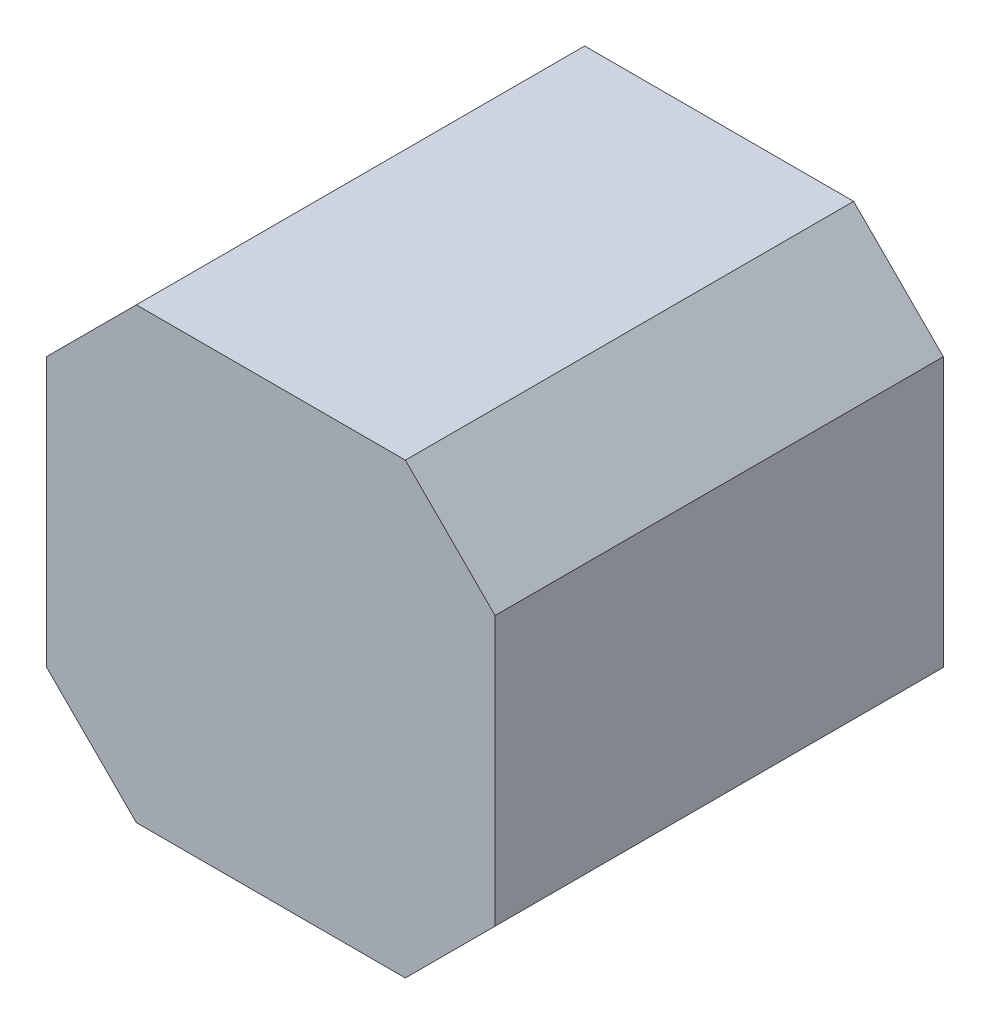
ISO-10303-21;
HEADER;
FILE_DESCRIPTION(('STEP AP214'),'2;1');
FILE_NAME('part.step','',(''),(''),'','','');
FILE_SCHEMA(('AUTOMOTIVE_DESIGN { 1 0 10303 214 1 1 1 1 }'));
ENDSEC;
DATA;
#1=APPLICATION_CONTEXT('core data for automotive mechanical design processes');
#2=APPLICATION_PROTOCOL_DEFINITION('international standard','automotive_design',2000,#1);
#3=PRODUCT_CONTEXT('',#1,'mechanical');
#4=PRODUCT('Part','Part','',(#3));
#5=PRODUCT_RELATED_PRODUCT_CATEGORY('part','',(#4));
#6=PRODUCT_DEFINITION_FORMATION('','',#4);
#7=PRODUCT_DEFINITION_CONTEXT('part definition',#1,'design');
#8=PRODUCT_DEFINITION('design','',#6,#7);
#9=PRODUCT_DEFINITION_SHAPE('','',#8);
#10=(LENGTH_UNIT() NAMED_UNIT(*) SI_UNIT(.MILLI.,.METRE.));
#11=(NAMED_UNIT(*) PLANE_ANGLE_UNIT() SI_UNIT($,.RADIAN.));
#12=(NAMED_UNIT(*) SI_UNIT($,.STERADIAN.) SOLID_ANGLE_UNIT());
#13=UNCERTAINTY_MEASURE_WITH_UNIT(LENGTH_MEASURE(1.E-05),#10,'distance_accuracy_value','');
#14=(GEOMETRIC_REPRESENTATION_CONTEXT(3) GLOBAL_UNCERTAINTY_ASSIGNED_CONTEXT((#13)) GLOBAL_UNIT_ASSIGNED_CONTEXT((#10,
#11,#12)) REPRESENTATION_CONTEXT('',''));
#15=CARTESIAN_POINT('',(0.,0.,0.));
#16=DIRECTION('',(0.,0.,1.));
#17=DIRECTION('',(1.,0.,0.));
#18=AXIS2_PLACEMENT_3D('',#15,#16,#17);
#19=CARTESIAN_POINT('',(1.270508,0.7622286,0.));
#20=DIRECTION('',(1.,0.,0.));
#21=DIRECTION('',(0.,0.,-1.));
#22=AXIS2_PLACEMENT_3D('',#19,#20,#21);
#23=PLANE('',#22);
#24=DIRECTION('',(0.,0.,1.));
#25=VECTOR('',#24,1.);
#26=CARTESIAN_POINT('',(1.270508,-0.76218796,0.));
#27=LINE('',#26,#25);
#28=CARTESIAN_POINT('',(1.270508,-0.76218796,0.));
#29=VERTEX_POINT('',#28);
#30=CARTESIAN_POINT('',(1.270508,-0.76218796,2.54));
#31=VERTEX_POINT('',#30);
#32=EDGE_CURVE('E159',#29,#31,#27,.T.);
#33=ORIENTED_EDGE('',*,*,#32,.F.);
#34=DIRECTION('',(0.,1.,0.));
#35=VECTOR('',#34,1.);
#36=CARTESIAN_POINT('',(1.270508,0.7622286,0.));
#37=LINE('',#36,#35);
#38=CARTESIAN_POINT('',(1.270508,0.7622286,0.));
#39=VERTEX_POINT('',#38);
#40=EDGE_CURVE('E92',#29,#39,#37,.T.);
#41=ORIENTED_EDGE('',*,*,#40,.T.);
#42=DIRECTION('',(0.,0.,1.));
#43=VECTOR('',#42,1.);
#44=CARTESIAN_POINT('',(1.270508,0.7622286,0.));
#45=LINE('',#44,#43);
#46=CARTESIAN_POINT('',(1.270508,0.7622286,2.54));
#47=VERTEX_POINT('',#46);
#48=EDGE_CURVE('E78',#47,#39,#45,.F.);
#49=ORIENTED_EDGE('',*,*,#48,.F.);
#50=DIRECTION('',(0.,1.,0.));
#51=VECTOR('',#50,1.);
#52=CARTESIAN_POINT('',(1.270508,0.7622286,2.54));
#53=LINE('',#52,#51);
#54=EDGE_CURVE('E68',#47,#31,#53,.F.);
#55=ORIENTED_EDGE('',*,*,#54,.T.);
#56=EDGE_LOOP('',(#33,#41,#49,#55));
#57=FACE_BOUND('',#56,.T.);
#58=ADVANCED_FACE('F17',(#57),#23,.T.);
#59=CARTESIAN_POINT('',(1.270508,-0.76218796,0.));
#60=DIRECTION('',(0.707106781186548,-0.707106781186548,0.));
#61=DIRECTION('',(0.707106781186548,0.707106781186548,0.));
#62=AXIS2_PLACEMENT_3D('',#59,#60,#61);
#63=PLANE('',#62);
#64=DIRECTION('',(0.,0.,1.));
#65=VECTOR('',#64,1.);
#66=CARTESIAN_POINT('',(0.76220828,-1.27048768,0.));
#67=LINE('',#66,#65);
#68=CARTESIAN_POINT('',(0.76220828,-1.27048768,0.));
#69=VERTEX_POINT('',#68);
#70=CARTESIAN_POINT('',(0.76220828,-1.27048768,2.54));
#71=VERTEX_POINT('',#70);
#72=EDGE_CURVE('E96',#69,#71,#67,.T.);
#73=ORIENTED_EDGE('',*,*,#72,.F.);
#74=DIRECTION('',(0.707106781186548,0.707106781186548,0.));
#75=VECTOR('',#74,1.);
#76=CARTESIAN_POINT('',(1.270508,-0.76218796,0.));
#77=LINE('',#76,#75);
#78=EDGE_CURVE('E85',#69,#29,#77,.T.);
#79=ORIENTED_EDGE('',*,*,#78,.T.);
#80=ORIENTED_EDGE('',*,*,#32,.T.);
#81=DIRECTION('',(0.707106781186548,0.707106781186548,0.));
#82=VECTOR('',#81,1.);
#83=CARTESIAN_POINT('',(1.270508,-0.76218796,2.54));
#84=LINE('',#83,#82);
#85=EDGE_CURVE('E91',#31,#71,#84,.F.);
#86=ORIENTED_EDGE('',*,*,#85,.T.);
#87=EDGE_LOOP('',(#73,#79,#80,#86));
#88=FACE_BOUND('',#87,.T.);
#89=ADVANCED_FACE('F169',(#88),#63,.T.);
#90=CARTESIAN_POINT('',(0.76220828,1.27052832,0.));
#91=DIRECTION('',(0.707106781186548,0.707106781186548,0.));
#92=DIRECTION('',(-0.707106781186548,0.707106781186548,0.));
#93=AXIS2_PLACEMENT_3D('',#90,#91,#92);
#94=PLANE('',#93);
#95=ORIENTED_EDGE('',*,*,#48,.T.);
#96=DIRECTION('',(-0.707106781186548,0.707106781186548,0.));
#97=VECTOR('',#96,1.);
#98=CARTESIAN_POINT('',(0.76220828,1.27052832,0.));
#99=LINE('',#98,#97);
#100=CARTESIAN_POINT('',(0.76220828,1.27052832,0.));
#101=VERTEX_POINT('',#100);
#102=EDGE_CURVE('E94',#39,#101,#99,.T.);
#103=ORIENTED_EDGE('',*,*,#102,.T.);
#104=DIRECTION('',(0.,0.,1.));
#105=VECTOR('',#104,1.);
#106=CARTESIAN_POINT('',(0.76220828,1.27052832,0.));
#107=LINE('',#106,#105);
#108=CARTESIAN_POINT('',(0.76220828,1.27052832,2.54));
#109=VERTEX_POINT('',#108);
#110=EDGE_CURVE('E81',#109,#101,#107,.F.);
#111=ORIENTED_EDGE('',*,*,#110,.F.);
#112=DIRECTION('',(-0.707106781186548,0.707106781186548,0.));
#113=VECTOR('',#112,1.);
#114=CARTESIAN_POINT('',(0.76220828,1.27052832,2.54));
#115=LINE('',#114,#113);
#116=EDGE_CURVE('E75',#109,#47,#115,.F.);
#117=ORIENTED_EDGE('',*,*,#116,.T.);
#118=EDGE_LOOP('',(#95,#103,#111,#117));
#119=FACE_BOUND('',#118,.T.);
#120=ADVANCED_FACE('F76',(#119),#94,.T.);
#121=CARTESIAN_POINT('',(0.76220828,-1.27048768,0.));
#122=DIRECTION('',(-7.83026645502871E-05,-0.999999996934346,0.));
#123=DIRECTION('',(0.999999996934346,-7.83026645502871E-05,0.));
#124=AXIS2_PLACEMENT_3D('',#121,#122,#123);
#125=PLANE('',#124);
#126=DIRECTION('',(0.,0.,1.));
#127=VECTOR('',#126,1.);
#128=CARTESIAN_POINT('',(-0.762327655226297,-1.2703683047737,0.));
#129=LINE('',#128,#127);
#130=CARTESIAN_POINT('',(-0.762343707192333,-1.27034585939998,0.));
#131=VERTEX_POINT('',#130);
#132=CARTESIAN_POINT('',(-0.762343707192333,-1.27034585939998,2.54));
#133=VERTEX_POINT('',#132);
#134=EDGE_CURVE('E106',#131,#133,#129,.T.);
#135=ORIENTED_EDGE('',*,*,#134,.F.);
#136=DIRECTION('',(0.999999996934346,-7.83026645502871E-05,0.));
#137=VECTOR('',#136,1.);
#138=CARTESIAN_POINT('',(0.76220828,-1.27048768,0.));
#139=LINE('',#138,#137);
#140=EDGE_CURVE('E122',#131,#69,#139,.T.);
#141=ORIENTED_EDGE('',*,*,#140,.T.);
#142=ORIENTED_EDGE('',*,*,#72,.T.);
#143=DIRECTION('',(0.999999996934346,-7.83026645502871E-05,0.));
#144=VECTOR('',#143,1.);
#145=CARTESIAN_POINT('',(0.76220828,-1.27048768,2.54));
#146=LINE('',#145,#144);
#147=EDGE_CURVE('E144',#71,#133,#146,.F.);
#148=ORIENTED_EDGE('',*,*,#147,.T.);
#149=EDGE_LOOP('',(#135,#141,#142,#148));
#150=FACE_BOUND('',#149,.T.);
#151=ADVANCED_FACE('F172',(#150),#125,.T.);
#152=CARTESIAN_POINT('',(-0.76220828,1.27052832,0.));
#153=DIRECTION('',(0.,1.,0.));
#154=DIRECTION('',(0.,0.,1.));
#155=AXIS2_PLACEMENT_3D('',#152,#153,#154);
#156=PLANE('',#155);
#157=ORIENTED_EDGE('',*,*,#110,.T.);
#158=DIRECTION('',(1.,0.,0.));
#159=VECTOR('',#158,1.);
#160=CARTESIAN_POINT('',(-0.76220828,1.27052832,0.));
#161=LINE('',#160,#159);
#162=CARTESIAN_POINT('',(-0.76220828,1.27052832,0.));
#163=VERTEX_POINT('',#162);
#164=EDGE_CURVE('E108',#101,#163,#161,.F.);
#165=ORIENTED_EDGE('',*,*,#164,.T.);
#166=DIRECTION('',(0.,0.,1.));
#167=VECTOR('',#166,1.);
#168=CARTESIAN_POINT('',(-0.76220828,1.27052832,0.));
#169=LINE('',#168,#167);
#170=CARTESIAN_POINT('',(-0.76220828,1.27052832,2.54));
#171=VERTEX_POINT('',#170);
#172=EDGE_CURVE('E178',#171,#163,#169,.F.);
#173=ORIENTED_EDGE('',*,*,#172,.F.);
#174=DIRECTION('',(1.,0.,0.));
#175=VECTOR('',#174,1.);
#176=CARTESIAN_POINT('',(-0.76238608,1.27052832,2.54));
#177=LINE('',#176,#175);
#178=EDGE_CURVE('E113',#109,#171,#177,.F.);
#179=ORIENTED_EDGE('',*,*,#178,.F.);
#180=EDGE_LOOP('',(#157,#165,#173,#179));
#181=FACE_BOUND('',#180,.T.);
#182=ADVANCED_FACE('F193',(#181),#156,.T.);
#183=CARTESIAN_POINT('',(-0.76238608,-1.27030988,0.));
#184=DIRECTION('',(-0.707106781186548,-0.707106781186548,0.));
#185=DIRECTION('',(0.707106781186548,-0.707106781186548,0.));
#186=AXIS2_PLACEMENT_3D('',#183,#184,#185);
#187=PLANE('',#186);
#188=DIRECTION('',(0.,0.,1.));
#189=VECTOR('',#188,1.);
#190=CARTESIAN_POINT('',(-1.270508,-0.76218796,0.));
#191=LINE('',#190,#189);
#192=CARTESIAN_POINT('',(-1.270508,-0.76218796,0.));
#193=VERTEX_POINT('',#192);
#194=CARTESIAN_POINT('',(-1.270508,-0.76218796,2.54));
#195=VERTEX_POINT('',#194);
#196=EDGE_CURVE('E127',#193,#195,#191,.T.);
#197=ORIENTED_EDGE('',*,*,#196,.F.);
#198=DIRECTION('',(0.707106781186548,-0.707106781186548,0.));
#199=VECTOR('',#198,1.);
#200=CARTESIAN_POINT('',(-0.76238608,-1.27030988,0.));
#201=LINE('',#200,#199);
#202=EDGE_CURVE('E35',#193,#131,#201,.T.);
#203=ORIENTED_EDGE('',*,*,#202,.T.);
#204=ORIENTED_EDGE('',*,*,#134,.T.);
#205=DIRECTION('',(0.707106781186548,-0.707106781186547,0.));
#206=VECTOR('',#205,1.);
#207=CARTESIAN_POINT('',(-1.270508,-0.76218796,2.54));
#208=LINE('',#207,#206);
#209=EDGE_CURVE('E173',#195,#133,#208,.T.);
#210=ORIENTED_EDGE('',*,*,#209,.F.);
#211=EDGE_LOOP('',(#197,#203,#204,#210));
#212=FACE_BOUND('',#211,.T.);
#213=ADVANCED_FACE('F197',(#212),#187,.T.);
#214=CARTESIAN_POINT('',(-0.76238608,-1.27030988,2.54));
#215=DIRECTION('',(0.,0.,1.));
#216=DIRECTION('',(1.,0.,0.));
#217=AXIS2_PLACEMENT_3D('',#214,#215,#216);
#218=PLANE('',#217);
#219=DIRECTION('',(0.,1.,0.));
#220=VECTOR('',#219,1.);
#221=CARTESIAN_POINT('',(-1.270508,-0.76218796,2.54));
#222=LINE('',#221,#220);
#223=CARTESIAN_POINT('',(-1.270508,0.7622286,2.54));
#224=VERTEX_POINT('',#223);
#225=EDGE_CURVE('E130',#195,#224,#222,.T.);
#226=ORIENTED_EDGE('',*,*,#225,.F.);
#227=ORIENTED_EDGE('',*,*,#209,.T.);
#228=ORIENTED_EDGE('',*,*,#147,.F.);
#229=ORIENTED_EDGE('',*,*,#85,.F.);
#230=ORIENTED_EDGE('',*,*,#54,.F.);
#231=ORIENTED_EDGE('',*,*,#116,.F.);
#232=ORIENTED_EDGE('',*,*,#178,.T.);
#233=DIRECTION('',(-0.707106781186548,-0.707106781186548,0.));
#234=VECTOR('',#233,1.);
#235=CARTESIAN_POINT('',(-1.270508,0.7622286,2.54));
#236=LINE('',#235,#234);
#237=EDGE_CURVE('E175',#224,#171,#236,.F.);
#238=ORIENTED_EDGE('',*,*,#237,.F.);
#239=EDGE_LOOP('',(#226,#227,#228,#229,#230,#231,#232,#238));
#240=FACE_BOUND('',#239,.T.);
#241=ADVANCED_FACE('F89',(#240),#218,.T.);
#242=CARTESIAN_POINT('',(-1.270508,0.7622286,0.));
#243=DIRECTION('',(-0.707106781186548,0.707106781186548,0.));
#244=DIRECTION('',(-0.707106781186548,-0.707106781186548,0.));
#245=AXIS2_PLACEMENT_3D('',#242,#243,#244);
#246=PLANE('',#245);
#247=ORIENTED_EDGE('',*,*,#172,.T.);
#248=DIRECTION('',(-0.707106781186548,-0.707106781186548,0.));
#249=VECTOR('',#248,1.);
#250=CARTESIAN_POINT('',(-1.270508,0.7622286,0.));
#251=LINE('',#250,#249);
#252=CARTESIAN_POINT('',(-1.270508,0.7622286,0.));
#253=VERTEX_POINT('',#252);
#254=EDGE_CURVE('E131',#163,#253,#251,.T.);
#255=ORIENTED_EDGE('',*,*,#254,.T.);
#256=DIRECTION('',(0.,0.,1.));
#257=VECTOR('',#256,1.);
#258=CARTESIAN_POINT('',(-1.270508,0.7622286,0.));
#259=LINE('',#258,#257);
#260=EDGE_CURVE('E26',#224,#253,#259,.F.);
#261=ORIENTED_EDGE('',*,*,#260,.F.);
#262=ORIENTED_EDGE('',*,*,#237,.T.);
#263=EDGE_LOOP('',(#247,#255,#261,#262));
#264=FACE_BOUND('',#263,.T.);
#265=ADVANCED_FACE('F192',(#264),#246,.T.);
#266=CARTESIAN_POINT('',(-1.270508,-0.76218796,0.));
#267=DIRECTION('',(-1.,0.,0.));
#268=DIRECTION('',(0.,0.,1.));
#269=AXIS2_PLACEMENT_3D('',#266,#267,#268);
#270=PLANE('',#269);
#271=ORIENTED_EDGE('',*,*,#260,.T.);
#272=DIRECTION('',(0.,1.,0.));
#273=VECTOR('',#272,1.);
#274=CARTESIAN_POINT('',(-1.270508,-1.27030988,0.));
#275=LINE('',#274,#273);
#276=EDGE_CURVE('E11',#253,#193,#275,.F.);
#277=ORIENTED_EDGE('',*,*,#276,.T.);
#278=ORIENTED_EDGE('',*,*,#196,.T.);
#279=ORIENTED_EDGE('',*,*,#225,.T.);
#280=EDGE_LOOP('',(#271,#277,#278,#279));
#281=FACE_BOUND('',#280,.T.);
#282=ADVANCED_FACE('F187',(#281),#270,.T.);
#283=CARTESIAN_POINT('',(-0.76238608,-1.27030988,0.));
#284=DIRECTION('',(0.,0.,1.));
#285=DIRECTION('',(1.,0.,0.));
#286=AXIS2_PLACEMENT_3D('',#283,#284,#285);
#287=PLANE('',#286);
#288=ORIENTED_EDGE('',*,*,#276,.F.);
#289=ORIENTED_EDGE('',*,*,#254,.F.);
#290=ORIENTED_EDGE('',*,*,#164,.F.);
#291=ORIENTED_EDGE('',*,*,#102,.F.);
#292=ORIENTED_EDGE('',*,*,#40,.F.);
#293=ORIENTED_EDGE('',*,*,#78,.F.);
#294=ORIENTED_EDGE('',*,*,#140,.F.);
#295=ORIENTED_EDGE('',*,*,#202,.F.);
#296=EDGE_LOOP('',(#288,#289,#290,#291,#292,#293,#294,#295));
#297=FACE_BOUND('',#296,.T.);
#298=ADVANCED_FACE('F170',(#297),#287,.F.);
#299=CLOSED_SHELL('',(#58,#89,#120,#151,#182,#213,#241,#265,#282,#298));
#300=MANIFOLD_SOLID_BREP('B1',#299);
#301=ADVANCED_BREP_SHAPE_REPRESENTATION('',(#18,#300),#14);
#302=SHAPE_DEFINITION_REPRESENTATION(#9,#301);
ENDSEC;
END-ISO-10303-21;
